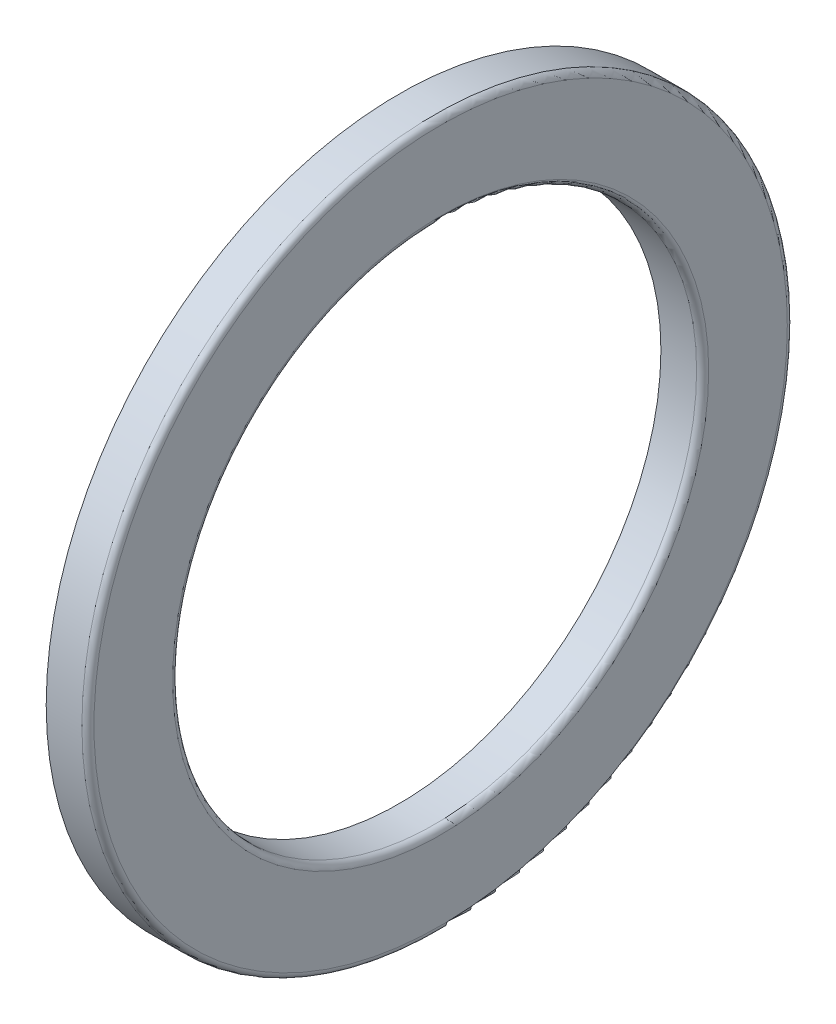
ISO-10303-21;
HEADER;
FILE_DESCRIPTION(('STEP AP214'),'2;1');
FILE_NAME('part.step','',(''),(''),'','','');
FILE_SCHEMA(('AUTOMOTIVE_DESIGN { 1 0 10303 214 1 1 1 1 }'));
ENDSEC;
DATA;
#1=APPLICATION_CONTEXT('core data for automotive mechanical design processes');
#2=APPLICATION_PROTOCOL_DEFINITION('international standard','automotive_design',2000,#1);
#3=PRODUCT_CONTEXT('',#1,'mechanical');
#4=PRODUCT('Part','Part','',(#3));
#5=PRODUCT_RELATED_PRODUCT_CATEGORY('part','',(#4));
#6=PRODUCT_DEFINITION_FORMATION('','',#4);
#7=PRODUCT_DEFINITION_CONTEXT('part definition',#1,'design');
#8=PRODUCT_DEFINITION('design','',#6,#7);
#9=PRODUCT_DEFINITION_SHAPE('','',#8);
#10=(LENGTH_UNIT() NAMED_UNIT(*) SI_UNIT(.MILLI.,.METRE.));
#11=(NAMED_UNIT(*) PLANE_ANGLE_UNIT() SI_UNIT($,.RADIAN.));
#12=(NAMED_UNIT(*) SI_UNIT($,.STERADIAN.) SOLID_ANGLE_UNIT());
#13=UNCERTAINTY_MEASURE_WITH_UNIT(LENGTH_MEASURE(1.E-05),#10,'distance_accuracy_value','');
#14=(GEOMETRIC_REPRESENTATION_CONTEXT(3) GLOBAL_UNCERTAINTY_ASSIGNED_CONTEXT((#13)) GLOBAL_UNIT_ASSIGNED_CONTEXT((#10,
#11,#12)) REPRESENTATION_CONTEXT('',''));
#15=CARTESIAN_POINT('',(0.,0.,0.));
#16=DIRECTION('',(0.,0.,1.));
#17=DIRECTION('',(1.,0.,0.));
#18=AXIS2_PLACEMENT_3D('',#15,#16,#17);
#19=CARTESIAN_POINT('',(9.858,27.857333437046,0.));
#20=DIRECTION('',(-1.,0.,0.));
#21=DIRECTION('',(0.,0.,1.));
#22=AXIS2_PLACEMENT_3D('',#19,#20,#21);
#23=PLANE('',#22);
#24=CARTESIAN_POINT('',(9.858,0.,0.));
#25=DIRECTION('',(1.,0.,0.));
#26=DIRECTION('',(0.,0.,-1.));
#27=AXIS2_PLACEMENT_3D('',#24,#25,#26);
#28=CIRCLE('',#27,26.);
#29=CARTESIAN_POINT('',(9.858,0.,-26.));
#30=VERTEX_POINT('',#29);
#31=EDGE_CURVE('E10',#30,#30,#28,.T.);
#32=ORIENTED_EDGE('',*,*,#31,.T.);
#33=EDGE_LOOP('',(#32));
#34=FACE_BOUND('',#33,.T.);
#35=CARTESIAN_POINT('',(9.858,0.,0.));
#36=DIRECTION('',(1.,0.,0.));
#37=DIRECTION('',(0.,0.,-1.));
#38=AXIS2_PLACEMENT_3D('',#35,#36,#37);
#39=CIRCLE('',#38,27.857333437046);
#40=CARTESIAN_POINT('',(9.858,0.,-27.857333437046));
#41=VERTEX_POINT('',#40);
#42=EDGE_CURVE('E57',#41,#41,#39,.T.);
#43=ORIENTED_EDGE('',*,*,#42,.F.);
#44=EDGE_LOOP('',(#43));
#45=FACE_BOUND('',#44,.T.);
#46=ADVANCED_FACE('F29',(#34,#45),#23,.T.);
#47=CARTESIAN_POINT('',(13.4,0.,0.));
#48=DIRECTION('',(1.,0.,0.));
#49=DIRECTION('',(0.,0.,-1.));
#50=AXIS2_PLACEMENT_3D('',#47,#48,#49);
#51=CYLINDRICAL_SURFACE('',#50,26.);
#52=CARTESIAN_POINT('',(13.4,0.,0.));
#53=DIRECTION('',(1.,0.,0.));
#54=DIRECTION('',(0.,0.,-1.));
#55=AXIS2_PLACEMENT_3D('',#52,#53,#54);
#56=CIRCLE('',#55,26.);
#57=CARTESIAN_POINT('',(13.4,0.,-26.));
#58=VERTEX_POINT('',#57);
#59=EDGE_CURVE('E35',#58,#58,#56,.T.);
#60=ORIENTED_EDGE('',*,*,#59,.T.);
#61=EDGE_LOOP('',(#60));
#62=FACE_BOUND('',#61,.T.);
#63=ORIENTED_EDGE('',*,*,#31,.F.);
#64=EDGE_LOOP('',(#63));
#65=FACE_BOUND('',#64,.T.);
#66=ADVANCED_FACE('F65',(#62,#65),#51,.F.);
#67=CARTESIAN_POINT('',(13.4000000000002,0.,0.));
#68=DIRECTION('',(1.,0.,0.));
#69=DIRECTION('',(0.,0.,-1.));
#70=AXIS2_PLACEMENT_3D('',#67,#68,#69);
#71=TOROIDAL_SURFACE('',#70,26.5999999999998,0.599999999999758);
#72=CARTESIAN_POINT('',(14.,0.,0.));
#73=DIRECTION('',(1.,0.,0.));
#74=DIRECTION('',(0.,0.,-1.));
#75=AXIS2_PLACEMENT_3D('',#72,#73,#74);
#76=CIRCLE('',#75,26.6);
#77=CARTESIAN_POINT('',(14.,0.,-26.6));
#78=VERTEX_POINT('',#77);
#79=EDGE_CURVE('E39',#78,#78,#76,.T.);
#80=ORIENTED_EDGE('',*,*,#79,.T.);
#81=EDGE_LOOP('',(#80));
#82=FACE_BOUND('',#81,.T.);
#83=ORIENTED_EDGE('',*,*,#59,.F.);
#84=EDGE_LOOP('',(#83));
#85=FACE_BOUND('',#84,.T.);
#86=ADVANCED_FACE('F69',(#82,#85),#71,.T.);
#87=CARTESIAN_POINT('',(14.,26.6,0.));
#88=DIRECTION('',(1.,0.,0.));
#89=DIRECTION('',(0.,0.,-1.));
#90=AXIS2_PLACEMENT_3D('',#87,#88,#89);
#91=PLANE('',#90);
#92=CARTESIAN_POINT('',(14.,0.,0.));
#93=DIRECTION('',(1.,0.,0.));
#94=DIRECTION('',(0.,0.,-1.));
#95=AXIS2_PLACEMENT_3D('',#92,#93,#94);
#96=CIRCLE('',#95,34.4);
#97=CARTESIAN_POINT('',(14.,0.,-34.4));
#98=VERTEX_POINT('',#97);
#99=EDGE_CURVE('E43',#98,#98,#96,.T.);
#100=ORIENTED_EDGE('',*,*,#99,.T.);
#101=EDGE_LOOP('',(#100));
#102=FACE_BOUND('',#101,.T.);
#103=ORIENTED_EDGE('',*,*,#79,.F.);
#104=EDGE_LOOP('',(#103));
#105=FACE_BOUND('',#104,.T.);
#106=ADVANCED_FACE('F73',(#102,#105),#91,.T.);
#107=CARTESIAN_POINT('',(13.4000000000002,0.,0.));
#108=DIRECTION('',(1.,0.,0.));
#109=DIRECTION('',(0.,0.,-1.));
#110=AXIS2_PLACEMENT_3D('',#107,#108,#109);
#111=TOROIDAL_SURFACE('',#110,34.4000000000002,0.59999999999976);
#112=CARTESIAN_POINT('',(13.4,0.,0.));
#113=DIRECTION('',(1.,0.,0.));
#114=DIRECTION('',(0.,0.,-1.));
#115=AXIS2_PLACEMENT_3D('',#112,#113,#114);
#116=CIRCLE('',#115,35.);
#117=CARTESIAN_POINT('',(13.4,0.,-35.));
#118=VERTEX_POINT('',#117);
#119=EDGE_CURVE('E48',#118,#118,#116,.T.);
#120=ORIENTED_EDGE('',*,*,#119,.T.);
#121=EDGE_LOOP('',(#120));
#122=FACE_BOUND('',#121,.T.);
#123=ORIENTED_EDGE('',*,*,#99,.F.);
#124=EDGE_LOOP('',(#123));
#125=FACE_BOUND('',#124,.T.);
#126=ADVANCED_FACE('F80',(#122,#125),#111,.T.);
#127=CARTESIAN_POINT('',(13.4,0.,0.));
#128=DIRECTION('',(1.,0.,0.));
#129=DIRECTION('',(0.,0.,-1.));
#130=AXIS2_PLACEMENT_3D('',#127,#128,#129);
#131=CYLINDRICAL_SURFACE('',#130,35.);
#132=CARTESIAN_POINT('',(9.858,0.,0.));
#133=DIRECTION('',(1.,0.,0.));
#134=DIRECTION('',(0.,0.,-1.));
#135=AXIS2_PLACEMENT_3D('',#132,#133,#134);
#136=CIRCLE('',#135,35.);
#137=CARTESIAN_POINT('',(9.858,0.,-35.));
#138=VERTEX_POINT('',#137);
#139=EDGE_CURVE('E51',#138,#138,#136,.T.);
#140=ORIENTED_EDGE('',*,*,#139,.T.);
#141=EDGE_LOOP('',(#140));
#142=FACE_BOUND('',#141,.T.);
#143=ORIENTED_EDGE('',*,*,#119,.F.);
#144=EDGE_LOOP('',(#143));
#145=FACE_BOUND('',#144,.T.);
#146=ADVANCED_FACE('F84',(#142,#145),#131,.T.);
#147=CARTESIAN_POINT('',(9.858,35.,0.));
#148=DIRECTION('',(-1.,0.,0.));
#149=DIRECTION('',(0.,0.,1.));
#150=AXIS2_PLACEMENT_3D('',#147,#148,#149);
#151=PLANE('',#150);
#152=CARTESIAN_POINT('',(9.858,0.,0.));
#153=DIRECTION('',(1.,0.,0.));
#154=DIRECTION('',(0.,0.,-1.));
#155=AXIS2_PLACEMENT_3D('',#152,#153,#154);
#156=CIRCLE('',#155,32.142666562954);
#157=CARTESIAN_POINT('',(9.858,0.,-32.142666562954));
#158=VERTEX_POINT('',#157);
#159=EDGE_CURVE('E54',#158,#158,#156,.T.);
#160=ORIENTED_EDGE('',*,*,#159,.T.);
#161=EDGE_LOOP('',(#160));
#162=FACE_BOUND('',#161,.T.);
#163=ORIENTED_EDGE('',*,*,#139,.F.);
#164=EDGE_LOOP('',(#163));
#165=FACE_BOUND('',#164,.T.);
#166=ADVANCED_FACE('F88',(#162,#165),#151,.T.);
#167=CARTESIAN_POINT('',(6.99999999999921,0.,0.));
#168=DIRECTION('',(1.,0.,0.));
#169=DIRECTION('',(0.,0.,-1.));
#170=AXIS2_PLACEMENT_3D('',#167,#168,#169);
#171=TOROIDAL_SURFACE('',#170,30.,3.57200000000078);
#172=ORIENTED_EDGE('',*,*,#42,.T.);
#173=EDGE_LOOP('',(#172));
#174=FACE_BOUND('',#173,.T.);
#175=ORIENTED_EDGE('',*,*,#159,.F.);
#176=EDGE_LOOP('',(#175));
#177=FACE_BOUND('',#176,.T.);
#178=ADVANCED_FACE('F61',(#174,#177),#171,.F.);
#179=CLOSED_SHELL('',(#46,#66,#86,#106,#126,#146,#166,#178));
#180=MANIFOLD_SOLID_BREP('B2',#179);
#181=ADVANCED_BREP_SHAPE_REPRESENTATION('',(#18,#180),#14);
#182=SHAPE_DEFINITION_REPRESENTATION(#9,#181);
ENDSEC;
END-ISO-10303-21;
